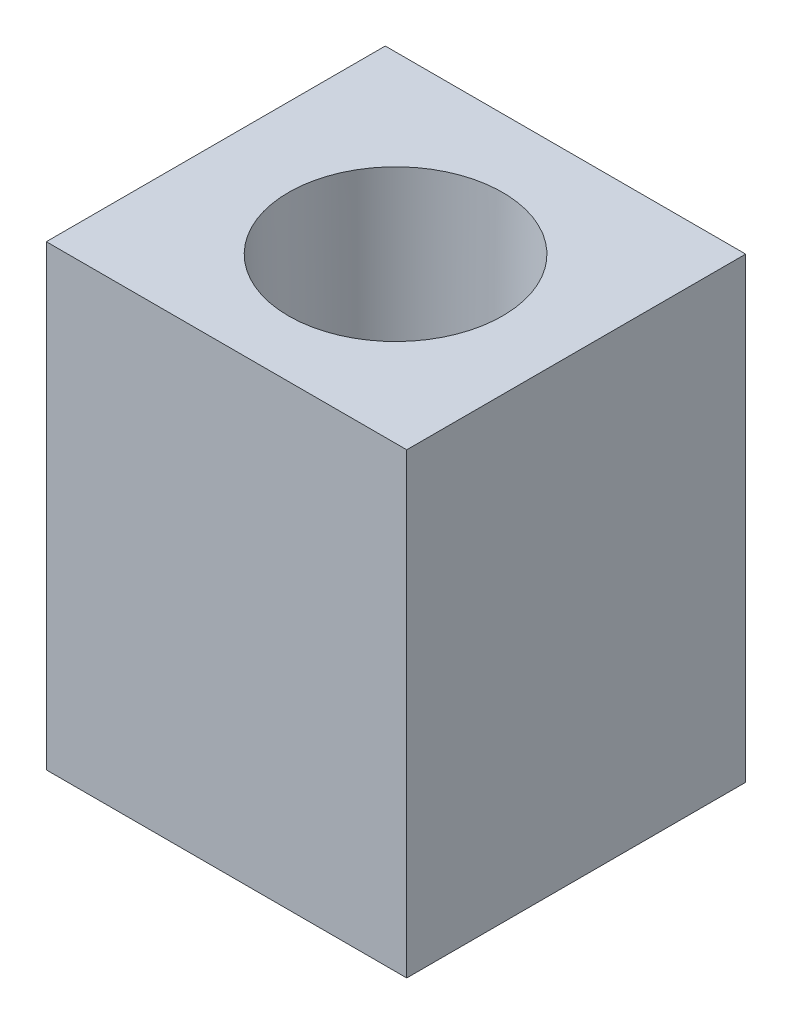
ISO-10303-21;
HEADER;
FILE_DESCRIPTION(('STEP AP214'),'2;1');
FILE_NAME('part.step','',(''),(''),'','','');
FILE_SCHEMA(('AUTOMOTIVE_DESIGN { 1 0 10303 214 1 1 1 1 }'));
ENDSEC;
DATA;
#1=APPLICATION_CONTEXT('core data for automotive mechanical design processes');
#2=APPLICATION_PROTOCOL_DEFINITION('international standard','automotive_design',2000,#1);
#3=PRODUCT_CONTEXT('',#1,'mechanical');
#4=PRODUCT('Part','Part','',(#3));
#5=PRODUCT_RELATED_PRODUCT_CATEGORY('part','',(#4));
#6=PRODUCT_DEFINITION_FORMATION('','',#4);
#7=PRODUCT_DEFINITION_CONTEXT('part definition',#1,'design');
#8=PRODUCT_DEFINITION('design','',#6,#7);
#9=PRODUCT_DEFINITION_SHAPE('','',#8);
#10=(LENGTH_UNIT() NAMED_UNIT(*) SI_UNIT(.MILLI.,.METRE.));
#11=(NAMED_UNIT(*) PLANE_ANGLE_UNIT() SI_UNIT($,.RADIAN.));
#12=(NAMED_UNIT(*) SI_UNIT($,.STERADIAN.) SOLID_ANGLE_UNIT());
#13=UNCERTAINTY_MEASURE_WITH_UNIT(LENGTH_MEASURE(1.E-05),#10,'distance_accuracy_value','');
#14=(GEOMETRIC_REPRESENTATION_CONTEXT(3) GLOBAL_UNCERTAINTY_ASSIGNED_CONTEXT((#13)) GLOBAL_UNIT_ASSIGNED_CONTEXT((#10,
#11,#12)) REPRESENTATION_CONTEXT('',''));
#15=CARTESIAN_POINT('',(0.,0.,0.));
#16=DIRECTION('',(0.,0.,1.));
#17=DIRECTION('',(1.,0.,0.));
#18=AXIS2_PLACEMENT_3D('',#15,#16,#17);
#19=CARTESIAN_POINT('',(-5.14803052450802,12.7,-4.86174577446211));
#20=DIRECTION('',(1.,0.,0.));
#21=DIRECTION('',(0.,0.,-1.));
#22=AXIS2_PLACEMENT_3D('',#19,#20,#21);
#23=PLANE('',#22);
#24=DIRECTION('',(0.,0.,1.));
#25=VECTOR('',#24,1.);
#26=CARTESIAN_POINT('',(-5.14803052450802,0.,-4.86174577446211));
#27=LINE('',#26,#25);
#28=CARTESIAN_POINT('',(-5.14803052450802,0.,-4.86174577446211));
#29=VERTEX_POINT('',#28);
#30=CARTESIAN_POINT('',(-5.14803052450802,0.,4.54808475675494));
#31=VERTEX_POINT('',#30);
#32=EDGE_CURVE('E110',#29,#31,#27,.T.);
#33=ORIENTED_EDGE('',*,*,#32,.T.);
#34=DIRECTION('',(0.,-1.,0.));
#35=VECTOR('',#34,1.);
#36=CARTESIAN_POINT('',(-5.14803052450802,12.7,4.54808475675494));
#37=LINE('',#36,#35);
#38=CARTESIAN_POINT('',(-5.14803052450802,12.7,4.54808475675494));
#39=VERTEX_POINT('',#38);
#40=EDGE_CURVE('E11',#39,#31,#37,.T.);
#41=ORIENTED_EDGE('',*,*,#40,.F.);
#42=DIRECTION('',(0.,0.,1.));
#43=VECTOR('',#42,1.);
#44=CARTESIAN_POINT('',(-5.14803052450802,12.7,-4.86174577446211));
#45=LINE('',#44,#43);
#46=CARTESIAN_POINT('',(-5.14803052450802,12.7,-4.86174577446211));
#47=VERTEX_POINT('',#46);
#48=EDGE_CURVE('E94',#47,#39,#45,.T.);
#49=ORIENTED_EDGE('',*,*,#48,.F.);
#50=DIRECTION('',(0.,-1.,0.));
#51=VECTOR('',#50,1.);
#52=CARTESIAN_POINT('',(-5.14803052450802,12.7,-4.86174577446211));
#53=LINE('',#52,#51);
#54=EDGE_CURVE('E106',#47,#29,#53,.T.);
#55=ORIENTED_EDGE('',*,*,#54,.T.);
#56=EDGE_LOOP('',(#33,#41,#49,#55));
#57=FACE_BOUND('',#56,.T.);
#58=ADVANCED_FACE('F42',(#57),#23,.F.);
#59=CARTESIAN_POINT('',(-5.14803052450802,12.7,4.54808475675494));
#60=DIRECTION('',(0.,0.,-1.));
#61=DIRECTION('',(-1.,0.,0.));
#62=AXIS2_PLACEMENT_3D('',#59,#60,#61);
#63=PLANE('',#62);
#64=DIRECTION('',(1.,0.,0.));
#65=VECTOR('',#64,1.);
#66=CARTESIAN_POINT('',(-5.14803052450802,0.,4.54808475675494));
#67=LINE('',#66,#65);
#68=CARTESIAN_POINT('',(4.85775594035278,0.,4.54808475675494));
#69=VERTEX_POINT('',#68);
#70=EDGE_CURVE('E99',#31,#69,#67,.T.);
#71=ORIENTED_EDGE('',*,*,#70,.T.);
#72=DIRECTION('',(0.,-1.,0.));
#73=VECTOR('',#72,1.);
#74=CARTESIAN_POINT('',(4.85775594035278,12.7,4.54808475675494));
#75=LINE('',#74,#73);
#76=CARTESIAN_POINT('',(4.85775594035278,12.7,4.54808475675494));
#77=VERTEX_POINT('',#76);
#78=EDGE_CURVE('E51',#77,#69,#75,.T.);
#79=ORIENTED_EDGE('',*,*,#78,.F.);
#80=DIRECTION('',(1.,0.,0.));
#81=VECTOR('',#80,1.);
#82=CARTESIAN_POINT('',(-5.14803052450802,12.7,4.54808475675494));
#83=LINE('',#82,#81);
#84=EDGE_CURVE('E89',#39,#77,#83,.T.);
#85=ORIENTED_EDGE('',*,*,#84,.F.);
#86=ORIENTED_EDGE('',*,*,#40,.T.);
#87=EDGE_LOOP('',(#71,#79,#85,#86));
#88=FACE_BOUND('',#87,.T.);
#89=ADVANCED_FACE('F98',(#88),#63,.F.);
#90=CARTESIAN_POINT('',(4.85775594035278,12.7,-4.86174577446211));
#91=DIRECTION('',(-1.,0.,0.));
#92=DIRECTION('',(0.,0.,1.));
#93=AXIS2_PLACEMENT_3D('',#90,#91,#92);
#94=PLANE('',#93);
#95=DIRECTION('',(0.,0.,-1.));
#96=VECTOR('',#95,1.);
#97=CARTESIAN_POINT('',(4.85775594035278,0.,-4.86174577446211));
#98=LINE('',#97,#96);
#99=CARTESIAN_POINT('',(4.85775594035278,0.,-4.86174577446211));
#100=VERTEX_POINT('',#99);
#101=EDGE_CURVE('E76',#69,#100,#98,.T.);
#102=ORIENTED_EDGE('',*,*,#101,.T.);
#103=DIRECTION('',(0.,-1.,0.));
#104=VECTOR('',#103,1.);
#105=CARTESIAN_POINT('',(4.85775594035278,12.7,-4.86174577446211));
#106=LINE('',#105,#104);
#107=CARTESIAN_POINT('',(4.85775594035278,12.7,-4.86174577446211));
#108=VERTEX_POINT('',#107);
#109=EDGE_CURVE('E101',#108,#100,#106,.T.);
#110=ORIENTED_EDGE('',*,*,#109,.F.);
#111=DIRECTION('',(0.,0.,-1.));
#112=VECTOR('',#111,1.);
#113=CARTESIAN_POINT('',(4.85775594035278,12.7,-4.86174577446211));
#114=LINE('',#113,#112);
#115=EDGE_CURVE('E92',#77,#108,#114,.T.);
#116=ORIENTED_EDGE('',*,*,#115,.F.);
#117=ORIENTED_EDGE('',*,*,#78,.T.);
#118=EDGE_LOOP('',(#102,#110,#116,#117));
#119=FACE_BOUND('',#118,.T.);
#120=ADVANCED_FACE('F102',(#119),#94,.F.);
#121=CARTESIAN_POINT('',(-5.14803052450802,12.7,-4.86174577446211));
#122=DIRECTION('',(0.,0.,1.));
#123=DIRECTION('',(1.,0.,0.));
#124=AXIS2_PLACEMENT_3D('',#121,#122,#123);
#125=PLANE('',#124);
#126=DIRECTION('',(-1.,0.,0.));
#127=VECTOR('',#126,1.);
#128=CARTESIAN_POINT('',(-5.14803052450802,0.,-4.86174577446211));
#129=LINE('',#128,#127);
#130=EDGE_CURVE('E82',#100,#29,#129,.T.);
#131=ORIENTED_EDGE('',*,*,#130,.T.);
#132=ORIENTED_EDGE('',*,*,#54,.F.);
#133=DIRECTION('',(-1.,0.,0.));
#134=VECTOR('',#133,1.);
#135=CARTESIAN_POINT('',(-5.14803052450802,12.7,-4.86174577446211));
#136=LINE('',#135,#134);
#137=EDGE_CURVE('E59',#108,#47,#136,.T.);
#138=ORIENTED_EDGE('',*,*,#137,.F.);
#139=ORIENTED_EDGE('',*,*,#109,.T.);
#140=EDGE_LOOP('',(#131,#132,#138,#139));
#141=FACE_BOUND('',#140,.T.);
#142=ADVANCED_FACE('F124',(#141),#125,.F.);
#143=CARTESIAN_POINT('',(0.,12.7,0.));
#144=DIRECTION('',(0.,1.,0.));
#145=DIRECTION('',(0.,0.,1.));
#146=AXIS2_PLACEMENT_3D('',#143,#144,#145);
#147=PLANE('',#146);
#148=CARTESIAN_POINT('',(0.,12.7,0.));
#149=DIRECTION('',(0.,1.,0.));
#150=DIRECTION('',(0.,0.,1.));
#151=AXIS2_PLACEMENT_3D('',#148,#149,#150);
#152=CIRCLE('',#151,2.9718);
#153=CARTESIAN_POINT('',(0.,12.7,2.9718));
#154=VERTEX_POINT('',#153);
#155=EDGE_CURVE('E114',#154,#154,#152,.T.);
#156=ORIENTED_EDGE('',*,*,#155,.F.);
#157=EDGE_LOOP('',(#156));
#158=FACE_BOUND('',#157,.T.);
#159=ORIENTED_EDGE('',*,*,#48,.T.);
#160=ORIENTED_EDGE('',*,*,#84,.T.);
#161=ORIENTED_EDGE('',*,*,#115,.T.);
#162=ORIENTED_EDGE('',*,*,#137,.T.);
#163=EDGE_LOOP('',(#159,#160,#161,#162));
#164=FACE_BOUND('',#163,.T.);
#165=ADVANCED_FACE('F90',(#158,#164),#147,.T.);
#166=CARTESIAN_POINT('',(0.,0.,0.));
#167=DIRECTION('',(0.,1.,0.));
#168=DIRECTION('',(0.,0.,1.));
#169=AXIS2_PLACEMENT_3D('',#166,#167,#168);
#170=PLANE('',#169);
#171=CARTESIAN_POINT('',(0.,0.,0.));
#172=DIRECTION('',(0.,1.,0.));
#173=DIRECTION('',(0.,0.,1.));
#174=AXIS2_PLACEMENT_3D('',#171,#172,#173);
#175=CIRCLE('',#174,2.86938308595556);
#176=CARTESIAN_POINT('',(0.,0.,2.86938308595556));
#177=VERTEX_POINT('',#176);
#178=EDGE_CURVE('E134',#177,#177,#175,.T.);
#179=ORIENTED_EDGE('',*,*,#178,.T.);
#180=EDGE_LOOP('',(#179));
#181=FACE_BOUND('',#180,.T.);
#182=ORIENTED_EDGE('',*,*,#32,.F.);
#183=ORIENTED_EDGE('',*,*,#130,.F.);
#184=ORIENTED_EDGE('',*,*,#101,.F.);
#185=ORIENTED_EDGE('',*,*,#70,.F.);
#186=EDGE_LOOP('',(#182,#183,#184,#185));
#187=FACE_BOUND('',#186,.T.);
#188=ADVANCED_FACE('F127',(#181,#187),#170,.F.);
#189=CARTESIAN_POINT('',(0.,12.7,0.));
#190=DIRECTION('',(0.,1.,0.));
#191=DIRECTION('',(0.,0.,1.));
#192=AXIS2_PLACEMENT_3D('',#189,#190,#191);
#193=CONICAL_SURFACE('',#192,2.9718,0.0183259571459405);
#194=CARTESIAN_POINT('',(0.,7.112,0.));
#195=DIRECTION('',(0.,1.,0.));
#196=DIRECTION('',(0.,0.,1.));
#197=AXIS2_PLACEMENT_3D('',#194,#195,#196);
#198=CIRCLE('',#197,2.86938308595556);
#199=CARTESIAN_POINT('',(0.,7.112,2.86938308595556));
#200=VERTEX_POINT('',#199);
#201=EDGE_CURVE('E135',#200,#200,#198,.T.);
#202=ORIENTED_EDGE('',*,*,#201,.F.);
#203=EDGE_LOOP('',(#202));
#204=FACE_BOUND('',#203,.T.);
#205=ORIENTED_EDGE('',*,*,#155,.T.);
#206=EDGE_LOOP('',(#205));
#207=FACE_BOUND('',#206,.T.);
#208=ADVANCED_FACE('F147',(#204,#207),#193,.F.);
#209=CARTESIAN_POINT('',(0.,0.,0.));
#210=DIRECTION('',(0.,1.,0.));
#211=DIRECTION('',(0.,0.,1.));
#212=AXIS2_PLACEMENT_3D('',#209,#210,#211);
#213=CYLINDRICAL_SURFACE('',#212,2.86938308595556);
#214=ORIENTED_EDGE('',*,*,#178,.F.);
#215=EDGE_LOOP('',(#214));
#216=FACE_BOUND('',#215,.T.);
#217=ORIENTED_EDGE('',*,*,#201,.T.);
#218=EDGE_LOOP('',(#217));
#219=FACE_BOUND('',#218,.T.);
#220=ADVANCED_FACE('F144',(#216,#219),#213,.F.);
#221=CLOSED_SHELL('',(#58,#89,#120,#142,#165,#188,#208,#220));
#222=MANIFOLD_SOLID_BREP('B2',#221);
#223=ADVANCED_BREP_SHAPE_REPRESENTATION('',(#18,#222),#14);
#224=SHAPE_DEFINITION_REPRESENTATION(#9,#223);
ENDSEC;
END-ISO-10303-21;
